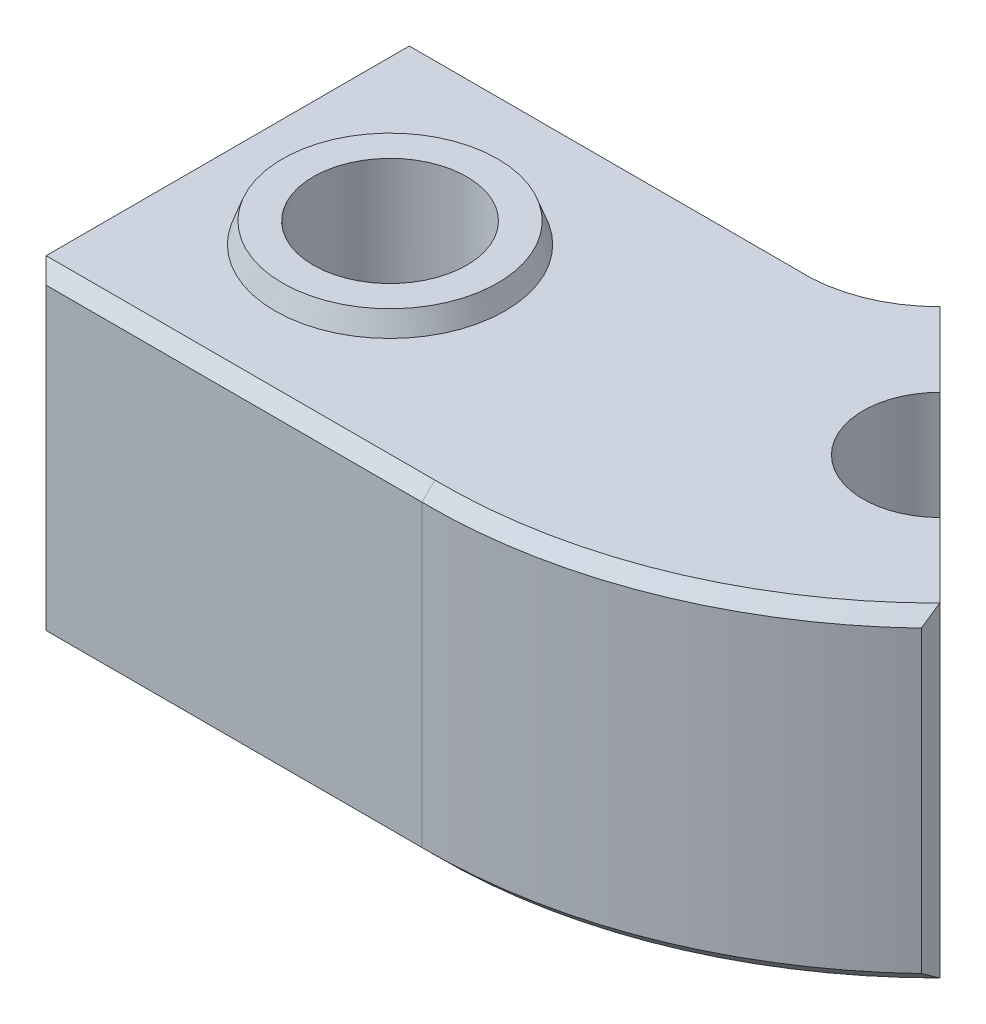
ISO-10303-21;
HEADER;
FILE_DESCRIPTION(('STEP AP214'),'2;1');
FILE_NAME('part.step','',(''),(''),'','','');
FILE_SCHEMA(('AUTOMOTIVE_DESIGN { 1 0 10303 214 1 1 1 1 }'));
ENDSEC;
DATA;
#1=APPLICATION_CONTEXT('core data for automotive mechanical design processes');
#2=APPLICATION_PROTOCOL_DEFINITION('international standard','automotive_design',2000,#1);
#3=PRODUCT_CONTEXT('',#1,'mechanical');
#4=PRODUCT('Part','Part','',(#3));
#5=PRODUCT_RELATED_PRODUCT_CATEGORY('part','',(#4));
#6=PRODUCT_DEFINITION_FORMATION('','',#4);
#7=PRODUCT_DEFINITION_CONTEXT('part definition',#1,'design');
#8=PRODUCT_DEFINITION('design','',#6,#7);
#9=PRODUCT_DEFINITION_SHAPE('','',#8);
#10=(LENGTH_UNIT() NAMED_UNIT(*) SI_UNIT(.MILLI.,.METRE.));
#11=(NAMED_UNIT(*) PLANE_ANGLE_UNIT() SI_UNIT($,.RADIAN.));
#12=(NAMED_UNIT(*) SI_UNIT($,.STERADIAN.) SOLID_ANGLE_UNIT());
#13=UNCERTAINTY_MEASURE_WITH_UNIT(LENGTH_MEASURE(1.E-05),#10,'distance_accuracy_value','');
#14=(GEOMETRIC_REPRESENTATION_CONTEXT(3) GLOBAL_UNCERTAINTY_ASSIGNED_CONTEXT((#13)) GLOBAL_UNIT_ASSIGNED_CONTEXT((#10,
#11,#12)) REPRESENTATION_CONTEXT('',''));
#15=CARTESIAN_POINT('',(0.,0.,0.));
#16=DIRECTION('',(0.,0.,1.));
#17=DIRECTION('',(1.,0.,0.));
#18=AXIS2_PLACEMENT_3D('',#15,#16,#17);
#19=CARTESIAN_POINT('',(-91.1181961207,-127.,123.955701479067));
#20=DIRECTION('',(0.,1.,0.));
#21=DIRECTION('',(0.,0.,1.));
#22=AXIS2_PLACEMENT_3D('',#19,#20,#21);
#23=CYLINDRICAL_SURFACE('',#22,30.);
#24=CARTESIAN_POINT('',(-91.1181961207,8.,123.955701479067));
#25=DIRECTION('',(0.,1.,0.));
#26=DIRECTION('',(0.,0.,1.));
#27=AXIS2_PLACEMENT_3D('',#24,#25,#26);
#28=CIRCLE('',#27,30.);
#29=CARTESIAN_POINT('',(-91.1181961207,8.,153.955701479067));
#30=VERTEX_POINT('',#29);
#31=EDGE_CURVE('E182',#30,#30,#28,.T.);
#32=ORIENTED_EDGE('',*,*,#31,.T.);
#33=EDGE_LOOP('',(#32));
#34=FACE_BOUND('',#33,.T.);
#35=CARTESIAN_POINT('',(-91.1181961207,-117.,123.955701479067));
#36=DIRECTION('',(0.,-1.,0.));
#37=DIRECTION('',(0.,0.,-1.));
#38=AXIS2_PLACEMENT_3D('',#35,#36,#37);
#39=CIRCLE('',#38,30.);
#40=CARTESIAN_POINT('',(-91.1181961207,-117.,93.9557014790674));
#41=VERTEX_POINT('',#40);
#42=EDGE_CURVE('E459',#41,#41,#39,.T.);
#43=ORIENTED_EDGE('',*,*,#42,.T.);
#44=EDGE_LOOP('',(#43));
#45=FACE_BOUND('',#44,.T.);
#46=ADVANCED_FACE('F35',(#34,#45),#23,.F.);
#47=CARTESIAN_POINT('',(0.,0.,0.));
#48=DIRECTION('',(0.,-1.,0.));
#49=DIRECTION('',(0.,0.,-1.));
#50=AXIS2_PLACEMENT_3D('',#47,#48,#49);
#51=PLANE('',#50);
#52=DIRECTION('',(-0.707106781186546,0.,-0.707106781186549));
#53=VECTOR('',#52,1.);
#54=CARTESIAN_POINT('',(33.9411254969542,0.,33.9411254969543));
#55=LINE('',#54,#53);
#56=CARTESIAN_POINT('',(66.4680374315353,0.,66.4680374315355));
#57=VERTEX_POINT('',#56);
#58=CARTESIAN_POINT('',(37.476659402887,0.,37.4766594028871));
#59=VERTEX_POINT('',#58);
#60=EDGE_CURVE('E185',#57,#59,#55,.T.);
#61=ORIENTED_EDGE('',*,*,#60,.T.);
#62=CARTESIAN_POINT('',(0.,0.,0.));
#63=DIRECTION('',(0.,-1.,0.));
#64=DIRECTION('',(0.,0.,-1.));
#65=AXIS2_PLACEMENT_3D('',#62,#63,#64);
#66=CIRCLE('',#65,53.0000000000001);
#67=CARTESIAN_POINT('',(-2.7512797438744,0.,52.9285410697382));
#68=VERTEX_POINT('',#67);
#69=EDGE_CURVE('E252',#59,#68,#66,.T.);
#70=ORIENTED_EDGE('',*,*,#69,.T.);
#71=DIRECTION('',(-1.,0.,0.));
#72=VECTOR('',#71,1.);
#73=CARTESIAN_POINT('',(-154.618196120696,0.,52.9285410697382));
#74=LINE('',#73,#72);
#75=CARTESIAN_POINT('',(-154.618196120696,0.,52.9285410697382));
#76=VERTEX_POINT('',#75);
#77=EDGE_CURVE('E250',#68,#76,#74,.T.);
#78=ORIENTED_EDGE('',*,*,#77,.T.);
#79=DIRECTION('',(0.,0.,1.));
#80=VECTOR('',#79,1.);
#81=CARTESIAN_POINT('',(-154.618196120696,0.,199.982861888397));
#82=LINE('',#81,#80);
#83=CARTESIAN_POINT('',(-154.618196120696,0.,194.982861888397));
#84=VERTEX_POINT('',#83);
#85=EDGE_CURVE('E178',#76,#84,#82,.T.);
#86=ORIENTED_EDGE('',*,*,#85,.T.);
#87=DIRECTION('',(1.,0.,0.));
#88=VECTOR('',#87,1.);
#89=CARTESIAN_POINT('',(-2.61819612069631,0.,194.982861888397));
#90=LINE('',#89,#88);
#91=CARTESIAN_POINT('',(-2.58526010498187,0.,194.982861888397));
#92=VERTEX_POINT('',#91);
#93=EDGE_CURVE('E244',#84,#92,#90,.T.);
#94=ORIENTED_EDGE('',*,*,#93,.T.);
#95=CARTESIAN_POINT('',(0.,0.,0.));
#96=DIRECTION('',(0.,-1.,0.));
#97=DIRECTION('',(0.,0.,-1.));
#98=AXIS2_PLACEMENT_3D('',#95,#96,#97);
#99=CIRCLE('',#98,195.);
#100=CARTESIAN_POINT('',(137.839310000962,0.,137.932318977311));
#101=VERTEX_POINT('',#100);
#102=EDGE_CURVE('E246',#92,#101,#99,.F.);
#103=ORIENTED_EDGE('',*,*,#102,.T.);
#104=DIRECTION('',(-0.012821566749017,0.,0.999917800334658));
#105=VECTOR('',#104,1.);
#106=CARTESIAN_POINT('',(137.748670374327,0.,145.001047617267));
#107=LINE('',#106,#105);
#108=CARTESIAN_POINT('',(137.840487520902,0.,137.840487520902));
#109=VERTEX_POINT('',#108);
#110=EDGE_CURVE('E248',#101,#109,#107,.F.);
#111=ORIENTED_EDGE('',*,*,#110,.T.);
#112=DIRECTION('',(-0.707106781186547,0.,-0.707106781186548));
#113=VECTOR('',#112,1.);
#114=CARTESIAN_POINT('',(108.894444302728,0.,108.894444302728));
#115=LINE('',#114,#113);
#116=CARTESIAN_POINT('',(108.894444302728,0.,108.894444302728));
#117=VERTEX_POINT('',#116);
#118=EDGE_CURVE('E181',#109,#117,#115,.T.);
#119=ORIENTED_EDGE('',*,*,#118,.T.);
#120=CARTESIAN_POINT('',(87.6812408671317,0.,87.681240867132));
#121=DIRECTION('',(0.,-1.,0.));
#122=DIRECTION('',(0.,0.,-1.));
#123=AXIS2_PLACEMENT_3D('',#120,#121,#122);
#124=CIRCLE('',#123,30.);
#125=EDGE_CURVE('E166',#117,#57,#124,.T.);
#126=ORIENTED_EDGE('',*,*,#125,.T.);
#127=EDGE_LOOP('',(#61,#70,#78,#86,#94,#103,#111,#119,#126));
#128=FACE_BOUND('',#127,.T.);
#129=CARTESIAN_POINT('',(-91.1181961207,0.,123.955701479067));
#130=DIRECTION('',(0.,-1.,0.));
#131=DIRECTION('',(0.,0.,-1.));
#132=AXIS2_PLACEMENT_3D('',#129,#130,#131);
#133=CIRCLE('',#132,45.);
#134=CARTESIAN_POINT('',(-91.1181961207,0.,78.9557014790674));
#135=VERTEX_POINT('',#134);
#136=EDGE_CURVE('E188',#135,#135,#133,.F.);
#137=ORIENTED_EDGE('',*,*,#136,.F.);
#138=EDGE_LOOP('',(#137));
#139=FACE_BOUND('',#138,.T.);
#140=ADVANCED_FACE('F391',(#128,#139),#51,.F.);
#141=CARTESIAN_POINT('',(0.,-127.,0.));
#142=DIRECTION('',(0.,1.,0.));
#143=DIRECTION('',(0.,0.,1.));
#144=AXIS2_PLACEMENT_3D('',#141,#142,#143);
#145=CYLINDRICAL_SURFACE('',#144,48.);
#146=DIRECTION('',(0.,1.,0.));
#147=VECTOR('',#146,1.);
#148=CARTESIAN_POINT('',(30.5877575605334,-127.,36.9917435033553));
#149=LINE('',#148,#147);
#150=CARTESIAN_POINT('',(30.5877575605334,-5.00000000000012,36.9917435033553));
#151=VERTEX_POINT('',#150);
#152=CARTESIAN_POINT('',(30.5877575605334,-122.,36.9917435033553));
#153=VERTEX_POINT('',#152);
#154=EDGE_CURVE('E229',#151,#153,#149,.F.);
#155=ORIENTED_EDGE('',*,*,#154,.T.);
#156=CARTESIAN_POINT('',(0.,-122.,0.));
#157=DIRECTION('',(0.,-1.,0.));
#158=DIRECTION('',(0.,0.,-1.));
#159=AXIS2_PLACEMENT_3D('',#156,#157,#158);
#160=CIRCLE('',#159,48.);
#161=CARTESIAN_POINT('',(-2.61819612069647,-122.,47.928541069738));
#162=VERTEX_POINT('',#161);
#163=EDGE_CURVE('E232',#153,#162,#160,.T.);
#164=ORIENTED_EDGE('',*,*,#163,.T.);
#165=DIRECTION('',(0.,1.,0.));
#166=VECTOR('',#165,1.);
#167=CARTESIAN_POINT('',(-2.61819612069647,-127.,47.928541069738));
#168=LINE('',#167,#166);
#169=CARTESIAN_POINT('',(-2.61819612069647,-5.00000000000012,47.928541069738));
#170=VERTEX_POINT('',#169);
#171=EDGE_CURVE('E174',#162,#170,#168,.T.);
#172=ORIENTED_EDGE('',*,*,#171,.T.);
#173=CARTESIAN_POINT('',(0.,-5.00000000000012,0.));
#174=DIRECTION('',(0.,-1.,0.));
#175=DIRECTION('',(0.,0.,-1.));
#176=AXIS2_PLACEMENT_3D('',#173,#174,#175);
#177=CIRCLE('',#176,48.);
#178=EDGE_CURVE('E227',#170,#151,#177,.F.);
#179=ORIENTED_EDGE('',*,*,#178,.T.);
#180=EDGE_LOOP('',(#155,#164,#172,#179));
#181=FACE_BOUND('',#180,.T.);
#182=ADVANCED_FACE('F398',(#181),#145,.F.);
#183=CARTESIAN_POINT('',(33.9411254969542,-127.,33.9411254969543));
#184=DIRECTION('',(0.707106781186549,0.,-0.707106781186546));
#185=DIRECTION('',(-0.707106781186546,0.,-0.707106781186549));
#186=AXIS2_PLACEMENT_3D('',#183,#184,#185);
#187=PLANE('',#186);
#188=DIRECTION('',(-0.707106781186546,0.,-0.707106781186549));
#189=VECTOR('',#188,1.);
#190=CARTESIAN_POINT('',(33.9411254969542,-127.,33.9411254969543));
#191=LINE('',#190,#189);
#192=CARTESIAN_POINT('',(66.4680374315353,-127.,66.4680374315355));
#193=VERTEX_POINT('',#192);
#194=CARTESIAN_POINT('',(37.476659402887,-127.,37.4766594028871));
#195=VERTEX_POINT('',#194);
#196=EDGE_CURVE('E172',#193,#195,#191,.T.);
#197=ORIENTED_EDGE('',*,*,#196,.T.);
#198=DIRECTION('',(0.499999999999999,-0.707106781186548,0.500000000000001));
#199=VECTOR('',#198,1.);
#200=CARTESIAN_POINT('',(0.,-73.9999999999999,0.));
#201=LINE('',#200,#199);
#202=CARTESIAN_POINT('',(37.3095162123552,-126.763623833092,37.3095162123554));
#203=VERTEX_POINT('',#202);
#204=EDGE_CURVE('E225',#195,#203,#201,.F.);
#205=ORIENTED_EDGE('',*,*,#204,.T.);
#206=DIRECTION('',(0.,1.,0.));
#207=VECTOR('',#206,1.);
#208=CARTESIAN_POINT('',(37.3095162123552,-127.,37.3095162123554));
#209=LINE('',#208,#207);
#210=CARTESIAN_POINT('',(37.3095162123552,-0.236376166908331,37.3095162123554));
#211=VERTEX_POINT('',#210);
#212=EDGE_CURVE('E222',#203,#211,#209,.T.);
#213=ORIENTED_EDGE('',*,*,#212,.T.);
#214=DIRECTION('',(-0.499999999999999,-0.707106781186548,-0.500000000000001));
#215=VECTOR('',#214,1.);
#216=CARTESIAN_POINT('',(0.,-53.0000000000001,0.));
#217=LINE('',#216,#215);
#218=EDGE_CURVE('E220',#211,#59,#217,.F.);
#219=ORIENTED_EDGE('',*,*,#218,.T.);
#220=ORIENTED_EDGE('',*,*,#60,.F.);
#221=DIRECTION('',(0.,1.,0.));
#222=VECTOR('',#221,1.);
#223=CARTESIAN_POINT('',(66.4680374315353,-127.,66.4680374315355));
#224=LINE('',#223,#222);
#225=EDGE_CURVE('E167',#193,#57,#224,.T.);
#226=ORIENTED_EDGE('',*,*,#225,.F.);
#227=EDGE_LOOP('',(#197,#205,#213,#219,#220,#226));
#228=FACE_BOUND('',#227,.T.);
#229=ADVANCED_FACE('F411',(#228),#187,.T.);
#230=CARTESIAN_POINT('',(87.6812408671317,-127.,87.681240867132));
#231=DIRECTION('',(0.,1.,0.));
#232=DIRECTION('',(0.,0.,1.));
#233=AXIS2_PLACEMENT_3D('',#230,#231,#232);
#234=CYLINDRICAL_SURFACE('',#233,30.);
#235=ORIENTED_EDGE('',*,*,#125,.F.);
#236=DIRECTION('',(0.,1.,0.));
#237=VECTOR('',#236,1.);
#238=CARTESIAN_POINT('',(108.894444302728,-127.,108.894444302728));
#239=LINE('',#238,#237);
#240=CARTESIAN_POINT('',(108.894444302728,-127.,108.894444302728));
#241=VERTEX_POINT('',#240);
#242=EDGE_CURVE('E152',#241,#117,#239,.T.);
#243=ORIENTED_EDGE('',*,*,#242,.F.);
#244=CARTESIAN_POINT('',(87.6812408671317,-127.,87.681240867132));
#245=DIRECTION('',(0.,-1.,0.));
#246=DIRECTION('',(0.,0.,-1.));
#247=AXIS2_PLACEMENT_3D('',#244,#245,#246);
#248=CIRCLE('',#247,30.);
#249=EDGE_CURVE('E158',#241,#193,#248,.T.);
#250=ORIENTED_EDGE('',*,*,#249,.T.);
#251=ORIENTED_EDGE('',*,*,#225,.T.);
#252=EDGE_LOOP('',(#235,#243,#250,#251));
#253=FACE_BOUND('',#252,.T.);
#254=ADVANCED_FACE('F163',(#253),#234,.F.);
#255=CARTESIAN_POINT('',(108.894444302728,-127.,108.894444302728));
#256=DIRECTION('',(0.707106781186548,0.,-0.707106781186547));
#257=DIRECTION('',(-0.707106781186547,0.,-0.707106781186548));
#258=AXIS2_PLACEMENT_3D('',#255,#256,#257);
#259=PLANE('',#258);
#260=ORIENTED_EDGE('',*,*,#118,.F.);
#261=DIRECTION('',(0.,-1.,0.));
#262=VECTOR('',#261,1.);
#263=CARTESIAN_POINT('',(137.840487520902,-127.,137.840487520902));
#264=LINE('',#263,#262);
#265=CARTESIAN_POINT('',(137.840487520902,-127.,137.840487520902));
#266=VERTEX_POINT('',#265);
#267=EDGE_CURVE('E11',#109,#266,#264,.T.);
#268=ORIENTED_EDGE('',*,*,#267,.T.);
#269=DIRECTION('',(-0.707106781186547,0.,-0.707106781186548));
#270=VECTOR('',#269,1.);
#271=CARTESIAN_POINT('',(108.894444302728,-127.,108.894444302728));
#272=LINE('',#271,#270);
#273=EDGE_CURVE('E148',#266,#241,#272,.T.);
#274=ORIENTED_EDGE('',*,*,#273,.T.);
#275=ORIENTED_EDGE('',*,*,#242,.T.);
#276=EDGE_LOOP('',(#260,#268,#274,#275));
#277=FACE_BOUND('',#276,.T.);
#278=ADVANCED_FACE('F151',(#277),#259,.T.);
#279=CARTESIAN_POINT('',(0.,-127.,0.));
#280=DIRECTION('',(0.,1.,0.));
#281=DIRECTION('',(0.,0.,1.));
#282=AXIS2_PLACEMENT_3D('',#279,#280,#281);
#283=CYLINDRICAL_SURFACE('',#282,200.);
#284=DIRECTION('',(0.,1.,0.));
#285=VECTOR('',#284,1.);
#286=CARTESIAN_POINT('',(-2.61819612069631,-127.,199.982861888397));
#287=LINE('',#286,#285);
#288=CARTESIAN_POINT('',(-2.61819612069631,-122.,199.982861888397));
#289=VERTEX_POINT('',#288);
#290=CARTESIAN_POINT('',(-2.61819612069631,-5.00000000000012,199.982861888397));
#291=VERTEX_POINT('',#290);
#292=EDGE_CURVE('E168',#289,#291,#287,.T.);
#293=ORIENTED_EDGE('',*,*,#292,.F.);
#294=CARTESIAN_POINT('',(0.,-122.,0.));
#295=DIRECTION('',(0.,-1.,0.));
#296=DIRECTION('',(0.,0.,-1.));
#297=AXIS2_PLACEMENT_3D('',#294,#295,#296);
#298=CIRCLE('',#297,200.);
#299=CARTESIAN_POINT('',(137.748670374327,-122.,145.001047617267));
#300=VERTEX_POINT('',#299);
#301=EDGE_CURVE('E45',#289,#300,#298,.F.);
#302=ORIENTED_EDGE('',*,*,#301,.T.);
#303=DIRECTION('',(0.,1.,0.));
#304=VECTOR('',#303,1.);
#305=CARTESIAN_POINT('',(137.748670374327,-127.,145.001047617267));
#306=LINE('',#305,#304);
#307=CARTESIAN_POINT('',(137.748670374327,-5.00000000000012,145.001047617267));
#308=VERTEX_POINT('',#307);
#309=EDGE_CURVE('E56',#300,#308,#306,.T.);
#310=ORIENTED_EDGE('',*,*,#309,.T.);
#311=CARTESIAN_POINT('',(0.,-5.00000000000012,0.));
#312=DIRECTION('',(0.,-1.,0.));
#313=DIRECTION('',(0.,0.,-1.));
#314=AXIS2_PLACEMENT_3D('',#311,#312,#313);
#315=CIRCLE('',#314,200.);
#316=EDGE_CURVE('E254',#308,#291,#315,.T.);
#317=ORIENTED_EDGE('',*,*,#316,.T.);
#318=EDGE_LOOP('',(#293,#302,#310,#317));
#319=FACE_BOUND('',#318,.T.);
#320=ADVANCED_FACE('F419',(#319),#283,.T.);
#321=CARTESIAN_POINT('',(-2.61819612069639,-127.,199.982861888397));
#322=DIRECTION('',(0.,0.,1.));
#323=DIRECTION('',(1.,0.,0.));
#324=AXIS2_PLACEMENT_3D('',#321,#322,#323);
#325=PLANE('',#324);
#326=DIRECTION('',(0.,-1.,0.));
#327=VECTOR('',#326,1.);
#328=CARTESIAN_POINT('',(-149.618196120696,-127.,199.982861888397));
#329=LINE('',#328,#327);
#330=CARTESIAN_POINT('',(-149.618196120696,-5.00000000000012,199.982861888397));
#331=VERTEX_POINT('',#330);
#332=CARTESIAN_POINT('',(-149.618196120696,-122.,199.982861888397));
#333=VERTEX_POINT('',#332);
#334=EDGE_CURVE('E204',#331,#333,#329,.T.);
#335=ORIENTED_EDGE('',*,*,#334,.T.);
#336=DIRECTION('',(1.,0.,0.));
#337=VECTOR('',#336,1.);
#338=CARTESIAN_POINT('',(-2.61819612069639,-122.,199.982861888397));
#339=LINE('',#338,#337);
#340=EDGE_CURVE('E206',#333,#289,#339,.T.);
#341=ORIENTED_EDGE('',*,*,#340,.T.);
#342=ORIENTED_EDGE('',*,*,#292,.T.);
#343=DIRECTION('',(-1.,0.,0.));
#344=VECTOR('',#343,1.);
#345=CARTESIAN_POINT('',(-154.618196120696,-5.00000000000012,199.982861888397));
#346=LINE('',#345,#344);
#347=EDGE_CURVE('E202',#291,#331,#346,.T.);
#348=ORIENTED_EDGE('',*,*,#347,.T.);
#349=EDGE_LOOP('',(#335,#341,#342,#348));
#350=FACE_BOUND('',#349,.T.);
#351=ADVANCED_FACE('F422',(#350),#325,.T.);
#352=CARTESIAN_POINT('',(-154.618196120696,-127.,199.982861888397));
#353=DIRECTION('',(-1.,0.,0.));
#354=DIRECTION('',(0.,0.,1.));
#355=AXIS2_PLACEMENT_3D('',#352,#353,#354);
#356=PLANE('',#355);
#357=ORIENTED_EDGE('',*,*,#85,.F.);
#358=DIRECTION('',(0.,-1.,0.));
#359=VECTOR('',#358,1.);
#360=CARTESIAN_POINT('',(-154.618196120696,-127.,52.9285410697382));
#361=LINE('',#360,#359);
#362=CARTESIAN_POINT('',(-154.618196120696,-127.,52.9285410697382));
#363=VERTEX_POINT('',#362);
#364=EDGE_CURVE('E242',#76,#363,#361,.T.);
#365=ORIENTED_EDGE('',*,*,#364,.T.);
#366=DIRECTION('',(0.,0.,1.));
#367=VECTOR('',#366,1.);
#368=CARTESIAN_POINT('',(-154.618196120696,-127.,199.982861888397));
#369=LINE('',#368,#367);
#370=CARTESIAN_POINT('',(-154.618196120696,-127.,194.982861888397));
#371=VERTEX_POINT('',#370);
#372=EDGE_CURVE('E159',#363,#371,#369,.T.);
#373=ORIENTED_EDGE('',*,*,#372,.T.);
#374=DIRECTION('',(0.,1.,0.));
#375=VECTOR('',#374,1.);
#376=CARTESIAN_POINT('',(-154.618196120696,-127.,194.982861888397));
#377=LINE('',#376,#375);
#378=EDGE_CURVE('E240',#371,#84,#377,.T.);
#379=ORIENTED_EDGE('',*,*,#378,.T.);
#380=EDGE_LOOP('',(#357,#365,#373,#379));
#381=FACE_BOUND('',#380,.T.);
#382=ADVANCED_FACE('F425',(#381),#356,.T.);
#383=CARTESIAN_POINT('',(-154.618196120696,-127.,47.928541069738));
#384=DIRECTION('',(0.,0.,-1.));
#385=DIRECTION('',(-1.,0.,0.));
#386=AXIS2_PLACEMENT_3D('',#383,#384,#385);
#387=PLANE('',#386);
#388=ORIENTED_EDGE('',*,*,#171,.F.);
#389=DIRECTION('',(-1.,0.,0.));
#390=VECTOR('',#389,1.);
#391=CARTESIAN_POINT('',(-154.618196120696,-122.,47.928541069738));
#392=LINE('',#391,#390);
#393=CARTESIAN_POINT('',(-149.618196120696,-122.,47.928541069738));
#394=VERTEX_POINT('',#393);
#395=EDGE_CURVE('E238',#162,#394,#392,.T.);
#396=ORIENTED_EDGE('',*,*,#395,.T.);
#397=DIRECTION('',(0.,1.,0.));
#398=VECTOR('',#397,1.);
#399=CARTESIAN_POINT('',(-149.618196120696,-127.,47.928541069738));
#400=LINE('',#399,#398);
#401=CARTESIAN_POINT('',(-149.618196120696,-5.00000000000012,47.928541069738));
#402=VERTEX_POINT('',#401);
#403=EDGE_CURVE('E236',#394,#402,#400,.T.);
#404=ORIENTED_EDGE('',*,*,#403,.T.);
#405=DIRECTION('',(1.,0.,0.));
#406=VECTOR('',#405,1.);
#407=CARTESIAN_POINT('',(-2.61819612069647,-5.00000000000012,47.928541069738));
#408=LINE('',#407,#406);
#409=EDGE_CURVE('E234',#402,#170,#408,.T.);
#410=ORIENTED_EDGE('',*,*,#409,.T.);
#411=EDGE_LOOP('',(#388,#396,#404,#410));
#412=FACE_BOUND('',#411,.T.);
#413=ADVANCED_FACE('F408',(#412),#387,.T.);
#414=CARTESIAN_POINT('',(0.,-127.,0.));
#415=DIRECTION('',(0.,-1.,0.));
#416=DIRECTION('',(0.,0.,-1.));
#417=AXIS2_PLACEMENT_3D('',#414,#415,#416);
#418=PLANE('',#417);
#419=CARTESIAN_POINT('',(-91.1181961207,-127.,123.955701479067));
#420=DIRECTION('',(0.,-1.,0.));
#421=DIRECTION('',(0.,0.,-1.));
#422=AXIS2_PLACEMENT_3D('',#419,#420,#421);
#423=CIRCLE('',#422,45.);
#424=CARTESIAN_POINT('',(-91.1181961207,-127.,78.9557014790674));
#425=VERTEX_POINT('',#424);
#426=EDGE_CURVE('E454',#425,#425,#423,.T.);
#427=ORIENTED_EDGE('',*,*,#426,.F.);
#428=EDGE_LOOP('',(#427));
#429=FACE_BOUND('',#428,.T.);
#430=DIRECTION('',(1.,0.,0.));
#431=VECTOR('',#430,1.);
#432=CARTESIAN_POINT('',(0.,-127.,52.9285410697382));
#433=LINE('',#432,#431);
#434=CARTESIAN_POINT('',(-2.7512797438744,-127.,52.9285410697382));
#435=VERTEX_POINT('',#434);
#436=EDGE_CURVE('E216',#363,#435,#433,.T.);
#437=ORIENTED_EDGE('',*,*,#436,.T.);
#438=CARTESIAN_POINT('',(0.,-127.,0.));
#439=DIRECTION('',(0.,-1.,0.));
#440=DIRECTION('',(0.,0.,-1.));
#441=AXIS2_PLACEMENT_3D('',#438,#439,#440);
#442=CIRCLE('',#441,53.0000000000001);
#443=EDGE_CURVE('E218',#435,#195,#442,.F.);
#444=ORIENTED_EDGE('',*,*,#443,.T.);
#445=ORIENTED_EDGE('',*,*,#196,.F.);
#446=ORIENTED_EDGE('',*,*,#249,.F.);
#447=ORIENTED_EDGE('',*,*,#273,.F.);
#448=DIRECTION('',(0.012821566749017,0.,-0.999917800334658));
#449=VECTOR('',#448,1.);
#450=CARTESIAN_POINT('',(139.585013305819,-127.,1.78984568997972));
#451=LINE('',#450,#449);
#452=CARTESIAN_POINT('',(137.839310000962,-127.,137.932318977311));
#453=VERTEX_POINT('',#452);
#454=EDGE_CURVE('E209',#266,#453,#451,.F.);
#455=ORIENTED_EDGE('',*,*,#454,.T.);
#456=CARTESIAN_POINT('',(0.,-127.,0.));
#457=DIRECTION('',(0.,-1.,0.));
#458=DIRECTION('',(0.,0.,-1.));
#459=AXIS2_PLACEMENT_3D('',#456,#457,#458);
#460=CIRCLE('',#459,195.);
#461=CARTESIAN_POINT('',(-2.58526010498187,-127.,194.982861888397));
#462=VERTEX_POINT('',#461);
#463=EDGE_CURVE('E211',#453,#462,#460,.T.);
#464=ORIENTED_EDGE('',*,*,#463,.T.);
#465=DIRECTION('',(-1.,0.,0.));
#466=VECTOR('',#465,1.);
#467=CARTESIAN_POINT('',(0.,-127.,194.982861888397));
#468=LINE('',#467,#466);
#469=EDGE_CURVE('E213',#462,#371,#468,.T.);
#470=ORIENTED_EDGE('',*,*,#469,.T.);
#471=ORIENTED_EDGE('',*,*,#372,.F.);
#472=EDGE_LOOP('',(#437,#444,#445,#446,#447,#455,#464,#470,#471));
#473=FACE_BOUND('',#472,.T.);
#474=ADVANCED_FACE('F170',(#429,#473),#418,.T.);
#475=CARTESIAN_POINT('',(-91.1181961207,8.,123.955701479067));
#476=DIRECTION('',(0.,1.,0.));
#477=DIRECTION('',(0.,0.,1.));
#478=AXIS2_PLACEMENT_3D('',#475,#476,#477);
#479=PLANE('',#478);
#480=CARTESIAN_POINT('',(-91.1181961207,8.,123.955701479067));
#481=DIRECTION('',(0.,1.,0.));
#482=DIRECTION('',(0.,0.,1.));
#483=AXIS2_PLACEMENT_3D('',#480,#481,#482);
#484=CIRCLE('',#483,42.0882381258705);
#485=CARTESIAN_POINT('',(-91.1181961207,8.,166.043939604938));
#486=VERTEX_POINT('',#485);
#487=EDGE_CURVE('E196',#486,#486,#484,.T.);
#488=ORIENTED_EDGE('',*,*,#487,.T.);
#489=EDGE_LOOP('',(#488));
#490=FACE_BOUND('',#489,.T.);
#491=ORIENTED_EDGE('',*,*,#31,.F.);
#492=EDGE_LOOP('',(#491));
#493=FACE_BOUND('',#492,.T.);
#494=ADVANCED_FACE('F405',(#490,#493),#479,.T.);
#495=CARTESIAN_POINT('',(-91.1181961207,8.,123.955701479067));
#496=DIRECTION('',(0.,-1.,0.));
#497=DIRECTION('',(0.,0.,-1.));
#498=AXIS2_PLACEMENT_3D('',#495,#496,#497);
#499=CONICAL_SURFACE('',#498,42.0882381258705,0.349065850398861);
#500=ORIENTED_EDGE('',*,*,#136,.T.);
#501=EDGE_LOOP('',(#500));
#502=FACE_BOUND('',#501,.T.);
#503=ORIENTED_EDGE('',*,*,#487,.F.);
#504=EDGE_LOOP('',(#503));
#505=FACE_BOUND('',#504,.T.);
#506=ADVANCED_FACE('F437',(#502,#505),#499,.T.);
#507=CARTESIAN_POINT('',(-91.1181961207,-117.,123.955701479067));
#508=DIRECTION('',(0.,-1.,0.));
#509=DIRECTION('',(0.,0.,-1.));
#510=AXIS2_PLACEMENT_3D('',#507,#508,#509);
#511=PLANE('',#510);
#512=CARTESIAN_POINT('',(-91.1181961207,-117.,123.955701479067));
#513=DIRECTION('',(0.,-1.,0.));
#514=DIRECTION('',(0.,0.,-1.));
#515=AXIS2_PLACEMENT_3D('',#512,#513,#514);
#516=CIRCLE('',#515,41.3602976573379);
#517=CARTESIAN_POINT('',(-91.1181961207,-117.,82.5954038217295));
#518=VERTEX_POINT('',#517);
#519=EDGE_CURVE('E199',#518,#518,#516,.T.);
#520=ORIENTED_EDGE('',*,*,#519,.T.);
#521=EDGE_LOOP('',(#520));
#522=FACE_BOUND('',#521,.T.);
#523=ORIENTED_EDGE('',*,*,#42,.F.);
#524=EDGE_LOOP('',(#523));
#525=FACE_BOUND('',#524,.T.);
#526=ADVANCED_FACE('F441',(#522,#525),#511,.T.);
#527=CARTESIAN_POINT('',(-91.1181961207,-117.,123.955701479067));
#528=DIRECTION('',(0.,-1.,0.));
#529=DIRECTION('',(0.,0.,-1.));
#530=AXIS2_PLACEMENT_3D('',#527,#528,#529);
#531=CONICAL_SURFACE('',#530,41.3602976573379,0.349065850398871);
#532=CARTESIAN_POINT('',(-91.1181961207,-127.,78.9557014790674));
#533=CARTESIAN_POINT('',(-91.1181961207,-126.895833333333,78.9936150451368));
#534=CARTESIAN_POINT('',(-91.1181961207,-126.791666666667,79.0315286112062));
#535=CARTESIAN_POINT('',(-91.1181961207,-126.583333333333,79.107355743345));
#536=CARTESIAN_POINT('',(-91.1181961207,-126.479166666667,79.1452693094144));
#537=CARTESIAN_POINT('',(-91.1181961207,-126.270833333333,79.2210964415532));
#538=CARTESIAN_POINT('',(-91.1181961207,-126.166666666667,79.2590100076226));
#539=CARTESIAN_POINT('',(-91.1181961207,-125.958333333333,79.3348371397614));
#540=CARTESIAN_POINT('',(-91.1181961207,-125.854166666667,79.3727507058308));
#541=CARTESIAN_POINT('',(-91.1181961207,-125.645833333333,79.4485778379696));
#542=CARTESIAN_POINT('',(-91.1181961207,-125.541666666667,79.4864914040389));
#543=CARTESIAN_POINT('',(-91.1181961207,-125.333333333333,79.5623185361777));
#544=CARTESIAN_POINT('',(-91.1181961207,-125.229166666667,79.6002321022471));
#545=CARTESIAN_POINT('',(-91.1181961207,-125.020833333333,79.6760592343859));
#546=CARTESIAN_POINT('',(-91.1181961207,-124.916666666667,79.7139728004553));
#547=CARTESIAN_POINT('',(-91.1181961207,-124.708333333333,79.7897999325941));
#548=CARTESIAN_POINT('',(-91.1181961207,-124.604166666667,79.8277134986635));
#549=CARTESIAN_POINT('',(-91.1181961207,-124.395833333333,79.9035406308023));
#550=CARTESIAN_POINT('',(-91.1181961207,-124.291666666667,79.9414541968717));
#551=CARTESIAN_POINT('',(-91.1181961207,-124.083333333333,80.0172813290105));
#552=CARTESIAN_POINT('',(-91.1181961207,-123.979166666667,80.0551948950799));
#553=CARTESIAN_POINT('',(-91.1181961207,-123.770833333333,80.1310220272187));
#554=CARTESIAN_POINT('',(-91.1181961207,-123.666666666667,80.1689355932881));
#555=CARTESIAN_POINT('',(-91.1181961207,-123.458333333333,80.2447627254269));
#556=CARTESIAN_POINT('',(-91.1181961207,-123.354166666667,80.2826762914963));
#557=CARTESIAN_POINT('',(-91.1181961207,-123.145833333333,80.3585034236351));
#558=CARTESIAN_POINT('',(-91.1181961207,-123.041666666667,80.3964169897045));
#559=CARTESIAN_POINT('',(-91.1181961207,-122.833333333333,80.4722441218433));
#560=CARTESIAN_POINT('',(-91.1181961207,-122.729166666667,80.5101576879127));
#561=CARTESIAN_POINT('',(-91.1181961207,-122.520833333333,80.5859848200515));
#562=CARTESIAN_POINT('',(-91.1181961207,-122.416666666667,80.6238983861208));
#563=CARTESIAN_POINT('',(-91.1181961207,-122.208333333333,80.6997255182596));
#564=CARTESIAN_POINT('',(-91.1181961207,-122.104166666667,80.737639084329));
#565=CARTESIAN_POINT('',(-91.1181961207,-121.895833333333,80.8134662164678));
#566=CARTESIAN_POINT('',(-91.1181961207,-121.791666666667,80.8513797825372));
#567=CARTESIAN_POINT('',(-91.1181961207,-121.583333333333,80.927206914676));
#568=CARTESIAN_POINT('',(-91.1181961207,-121.479166666667,80.9651204807454));
#569=CARTESIAN_POINT('',(-91.1181961207,-121.270833333333,81.0409476128842));
#570=CARTESIAN_POINT('',(-91.1181961207,-121.166666666667,81.0788611789536));
#571=CARTESIAN_POINT('',(-91.1181961207,-120.958333333333,81.1546883110924));
#572=CARTESIAN_POINT('',(-91.1181961207,-120.854166666667,81.1926018771618));
#573=CARTESIAN_POINT('',(-91.1181961207,-120.645833333333,81.2684290093006));
#574=CARTESIAN_POINT('',(-91.1181961207,-120.541666666667,81.30634257537));
#575=CARTESIAN_POINT('',(-91.1181961207,-120.333333333333,81.3821697075088));
#576=CARTESIAN_POINT('',(-91.1181961207,-120.229166666667,81.4200832735782));
#577=CARTESIAN_POINT('',(-91.1181961207,-120.020833333333,81.495910405717));
#578=CARTESIAN_POINT('',(-91.1181961207,-119.916666666667,81.5338239717864));
#579=CARTESIAN_POINT('',(-91.1181961207,-119.708333333333,81.6096511039252));
#580=CARTESIAN_POINT('',(-91.1181961207,-119.604166666667,81.6475646699946));
#581=CARTESIAN_POINT('',(-91.1181961207,-119.395833333333,81.7233918021333));
#582=CARTESIAN_POINT('',(-91.1181961207,-119.291666666667,81.7613053682027));
#583=CARTESIAN_POINT('',(-91.1181961207,-119.083333333333,81.8371325003415));
#584=CARTESIAN_POINT('',(-91.1181961207,-118.979166666667,81.8750460664109));
#585=CARTESIAN_POINT('',(-91.1181961207,-118.770833333333,81.9508731985497));
#586=CARTESIAN_POINT('',(-91.1181961207,-118.666666666667,81.9887867646191));
#587=CARTESIAN_POINT('',(-91.1181961207,-118.458333333333,82.0646138967579));
#588=CARTESIAN_POINT('',(-91.1181961207,-118.354166666667,82.1025274628273));
#589=CARTESIAN_POINT('',(-91.1181961207,-118.145833333333,82.1783545949661));
#590=CARTESIAN_POINT('',(-91.1181961207,-118.041666666667,82.2162681610355));
#591=CARTESIAN_POINT('',(-91.1181961207,-117.833333333333,82.2920952931743));
#592=CARTESIAN_POINT('',(-91.1181961207,-117.729166666667,82.3300088592437));
#593=CARTESIAN_POINT('',(-91.1181961207,-117.520833333333,82.4058359913825));
#594=CARTESIAN_POINT('',(-91.1181961207,-117.416666666667,82.4437495574519));
#595=CARTESIAN_POINT('',(-91.1181961207,-117.208333333333,82.5195766895907));
#596=CARTESIAN_POINT('',(-91.1181961207,-117.104166666667,82.5574902556601));
#597=CARTESIAN_POINT('',(-91.1181961207,-117.,82.5954038217295));
#598=B_SPLINE_CURVE_WITH_KNOTS('',3,(#532,#533,#534,#535,#536,#537,#538,#539,#540,#541,#542,
#543,#544,#545,#546,#547,#548,#549,#550,#551,#552,#553,#554,#555,#556,#557,#558,#559,#560,#561,
#562,#563,#564,#565,#566,#567,#568,#569,#570,#571,#572,#573,#574,#575,#576,#577,#578,#579,#580,
#581,#582,#583,#584,#585,#586,#587,#588,#589,#590,#591,#592,#593,#594,#595,#596,#597),
.UNSPECIFIED.,.F.,.F.,(4,2,2,2,2,2,2,2,2,2,2,2,2,2,2,2,2,2,2,2,2,2,2,2,2,2,2,2,2,2,2,2,4),(0.,
0.332555553898716,0.665111107797432,0.997666661696147,1.33022221559486,1.66277776949361,
1.99533332339232,2.32788887729104,2.66044443118977,2.99299998508849,3.32555553898722,
3.65811109288594,3.99066664678465,4.32322220068338,4.6557777545821,4.98833330848083,
5.32088886237954,5.65344441627827,5.98599997017699,6.31855552407572,6.65111107797444,
6.98366663187317,7.31622218577188,7.6487777396706,7.98133329356933,8.31388884746804,
8.64644440136678,8.97899995526549,9.31155550916423,9.64411106306294,9.97666661696167,
10.3092221708604,10.6417777247591),.UNSPECIFIED.);
#599=EDGE_CURVE('BSEAM320',#425,#518,#598,.T.);
#600=ORIENTED_EDGE('',*,*,#426,.T.);
#601=ORIENTED_EDGE('',*,*,#519,.F.);
#602=ORIENTED_EDGE('',*,*,#599,.T.);
#603=ORIENTED_EDGE('',*,*,#599,.F.);
#604=EDGE_LOOP('',(#600,#602,#601,#603));
#605=FACE_BOUND('',#604,.T.);
#606=ADVANCED_FACE('F320',(#605),#531,.F.);
#607=CARTESIAN_POINT('',(0.,0.,0.));
#608=DIRECTION('',(0.,-1.,0.));
#609=DIRECTION('',(0.,0.,-1.));
#610=AXIS2_PLACEMENT_3D('',#607,#608,#609);
#611=CONICAL_SURFACE('',#610,195.,0.785398163397448);
#612=CARTESIAN_POINT('',(137.748670374327,-5.00000000000012,145.001047617267));
#613=CARTESIAN_POINT('',(137.756192304158,-4.57988273596643,144.414433541362));
#614=CARTESIAN_POINT('',(137.763721864013,-4.16059620242156,143.827224421319));
#615=CARTESIAN_POINT('',(137.778796507152,-3.32373521724659,142.651595552898));
#616=CARTESIAN_POINT('',(137.786341590297,-2.90616075043534,142.063175815324));
#617=CARTESIAN_POINT('',(137.801447679616,-2.07276691071571,140.885094548137));
#618=CARTESIAN_POINT('',(137.809008685795,-1.65694753839959,140.295433018105));
#619=CARTESIAN_POINT('',(137.824147027533,-0.827109751955586,139.114836475725));
#620=CARTESIAN_POINT('',(137.831724363237,-0.413091353864861,138.523901452108));
#621=CARTESIAN_POINT('',(137.839310000962,0.,137.932318977311));
#622=B_SPLINE_CURVE_WITH_KNOTS('',3,(#612,#613,#614,#615,#616,#617,#618,#619,#620,#621),
.UNSPECIFIED.,.F.,.F.,(4,2,2,2,4),(0.,2.16472593567518,4.329432634684,6.49414006412019,
8.65886673037118),.UNSPECIFIED.);
#623=EDGE_CURVE('E296',#101,#308,#622,.F.);
#624=ORIENTED_EDGE('',*,*,#623,.F.);
#625=ORIENTED_EDGE('',*,*,#102,.F.);
#626=CARTESIAN_POINT('',(-2.61819612069631,-5.00000000000012,199.982861888397));
#627=CARTESIAN_POINT('',(-2.61274152952287,-4.1666665522336,199.14952844063));
#628=CARTESIAN_POINT('',(-2.60726956595985,-3.33333316168482,198.316195050081));
#629=CARTESIAN_POINT('',(-2.5962908940546,-1.66666649501811,196.649528383415));
#630=CARTESIAN_POINT('',(-2.59078418571237,-0.833333218900193,195.816195107297));
#631=CARTESIAN_POINT('',(-2.58526010498055,0.,194.982861888397));
#632=B_SPLINE_CURVE_WITH_KNOTS('',3,(#626,#627,#628,#629,#630,#631),.UNSPECIFIED.,.F.,.F.,(4,2,
4),(0.,3.53557225890391,7.07114451782728),.UNSPECIFIED.);
#633=EDGE_CURVE('E304',#291,#92,#632,.T.);
#634=ORIENTED_EDGE('',*,*,#633,.F.);
#635=ORIENTED_EDGE('',*,*,#316,.F.);
#636=EDGE_LOOP('',(#624,#625,#634,#635));
#637=FACE_BOUND('',#636,.T.);
#638=ADVANCED_FACE('F312',(#637),#611,.T.);
#639=CARTESIAN_POINT('',(0.,0.,194.982861888397));
#640=DIRECTION('',(0.,0.707106781186548,0.707106781186548));
#641=DIRECTION('',(-1.,0.,0.));
#642=AXIS2_PLACEMENT_3D('',#639,#640,#641);
#643=PLANE('',#642);
#644=ORIENTED_EDGE('',*,*,#633,.T.);
#645=ORIENTED_EDGE('',*,*,#93,.F.);
#646=DIRECTION('',(-0.577350269189626,0.577350269189626,-0.577350269189626));
#647=VECTOR('',#646,1.);
#648=CARTESIAN_POINT('',(-103.078797413798,-51.5393987068988,246.522260595295));
#649=LINE('',#648,#647);
#650=EDGE_CURVE('E293',#331,#84,#649,.T.);
#651=ORIENTED_EDGE('',*,*,#650,.F.);
#652=ORIENTED_EDGE('',*,*,#347,.F.);
#653=EDGE_LOOP('',(#644,#645,#651,#652));
#654=FACE_BOUND('',#653,.T.);
#655=ADVANCED_FACE('F319',(#654),#643,.T.);
#656=CARTESIAN_POINT('',(137.748670374327,-127.,145.001047617267));
#657=DIRECTION('',(-0.999917800334658,0.,-0.012821566749017));
#658=DIRECTION('',(0.,1.,0.));
#659=AXIS2_PLACEMENT_3D('',#656,#657,#658);
#660=PLANE('',#659);
#661=ORIENTED_EDGE('',*,*,#623,.T.);
#662=ORIENTED_EDGE('',*,*,#309,.F.);
#663=CARTESIAN_POINT('',(137.748670374327,-122.,145.001047617267));
#664=CARTESIAN_POINT('',(137.756192304158,-122.420117264034,144.414433541362));
#665=CARTESIAN_POINT('',(137.763721864013,-122.839403797578,143.827224421319));
#666=CARTESIAN_POINT('',(137.778796507152,-123.676264782753,142.651595552898));
#667=CARTESIAN_POINT('',(137.786341590297,-124.093839249565,142.063175815324));
#668=CARTESIAN_POINT('',(137.801447679616,-124.927233089284,140.885094548137));
#669=CARTESIAN_POINT('',(137.809008685795,-125.3430524616,140.295433018105));
#670=CARTESIAN_POINT('',(137.824147027533,-126.172890248044,139.114836475726));
#671=CARTESIAN_POINT('',(137.831724363237,-126.586908646135,138.523901452108));
#672=CARTESIAN_POINT('',(137.839310000962,-127.,137.932318977311));
#673=B_SPLINE_CURVE_WITH_KNOTS('',3,(#663,#664,#665,#666,#667,#668,#669,#670,#671,#672),
.UNSPECIFIED.,.F.,.F.,(4,2,2,2,4),(0.,2.16472593567518,4.329432634684,6.49414006412016,
8.65886673037119),.UNSPECIFIED.);
#674=EDGE_CURVE('E286',#453,#300,#673,.F.);
#675=ORIENTED_EDGE('',*,*,#674,.F.);
#676=ORIENTED_EDGE('',*,*,#454,.F.);
#677=ORIENTED_EDGE('',*,*,#267,.F.);
#678=ORIENTED_EDGE('',*,*,#110,.F.);
#679=EDGE_LOOP('',(#661,#662,#675,#676,#677,#678));
#680=FACE_BOUND('',#679,.T.);
#681=ADVANCED_FACE('F282',(#680),#660,.F.);
#682=CARTESIAN_POINT('',(-154.618196120696,-127.,194.982861888397));
#683=DIRECTION('',(0.707106781186548,0.,-0.707106781186548));
#684=DIRECTION('',(0.,1.,0.));
#685=AXIS2_PLACEMENT_3D('',#682,#683,#684);
#686=PLANE('',#685);
#687=ORIENTED_EDGE('',*,*,#650,.T.);
#688=ORIENTED_EDGE('',*,*,#378,.F.);
#689=DIRECTION('',(0.577350269189626,0.577350269189626,0.577350269189626));
#690=VECTOR('',#689,1.);
#691=CARTESIAN_POINT('',(-154.618196120696,-127.,194.982861888397));
#692=LINE('',#691,#690);
#693=EDGE_CURVE('E266',#333,#371,#692,.F.);
#694=ORIENTED_EDGE('',*,*,#693,.F.);
#695=ORIENTED_EDGE('',*,*,#334,.F.);
#696=EDGE_LOOP('',(#687,#688,#694,#695));
#697=FACE_BOUND('',#696,.T.);
#698=ADVANCED_FACE('F280',(#697),#686,.F.);
#699=CARTESIAN_POINT('',(0.,-122.,0.));
#700=DIRECTION('',(0.,1.,0.));
#701=DIRECTION('',(0.,0.,1.));
#702=AXIS2_PLACEMENT_3D('',#699,#700,#701);
#703=CONICAL_SURFACE('',#702,200.,0.785398163397448);
#704=ORIENTED_EDGE('',*,*,#674,.T.);
#705=ORIENTED_EDGE('',*,*,#301,.F.);
#706=CARTESIAN_POINT('',(-2.61819612069631,-122.,199.982861888397));
#707=CARTESIAN_POINT('',(-2.61274152952289,-122.833333447766,199.14952844063));
#708=CARTESIAN_POINT('',(-2.60726956595989,-123.666666838315,198.316195050081));
#709=CARTESIAN_POINT('',(-2.59629089405464,-125.333333504982,196.649528383415));
#710=CARTESIAN_POINT('',(-2.59078418571241,-126.1666667811,195.816195107297));
#711=CARTESIAN_POINT('',(-2.58526010498058,-127.,194.982861888397));
#712=B_SPLINE_CURVE_WITH_KNOTS('',3,(#706,#707,#708,#709,#710,#711),.UNSPECIFIED.,.F.,.F.,(4,2,
4),(0.,3.53557225890391,7.07114451782728),.UNSPECIFIED.);
#713=EDGE_CURVE('E258',#462,#289,#712,.F.);
#714=ORIENTED_EDGE('',*,*,#713,.F.);
#715=ORIENTED_EDGE('',*,*,#463,.F.);
#716=EDGE_LOOP('',(#704,#705,#714,#715));
#717=FACE_BOUND('',#716,.T.);
#718=ADVANCED_FACE('F273',(#717),#703,.T.);
#719=CARTESIAN_POINT('',(-2.61819612069639,-122.,199.982861888397));
#720=DIRECTION('',(0.,0.707106781186548,-0.707106781186548));
#721=DIRECTION('',(1.,0.,0.));
#722=AXIS2_PLACEMENT_3D('',#719,#720,#721);
#723=PLANE('',#722);
#724=ORIENTED_EDGE('',*,*,#693,.T.);
#725=ORIENTED_EDGE('',*,*,#469,.F.);
#726=ORIENTED_EDGE('',*,*,#713,.T.);
#727=ORIENTED_EDGE('',*,*,#340,.F.);
#728=EDGE_LOOP('',(#724,#725,#726,#727));
#729=FACE_BOUND('',#728,.T.);
#730=ADVANCED_FACE('F269',(#729),#723,.F.);
#731=CARTESIAN_POINT('',(-149.618196120696,-127.,47.928541069738));
#732=DIRECTION('',(0.707106781186548,0.,0.707106781186548));
#733=DIRECTION('',(0.,1.,0.));
#734=AXIS2_PLACEMENT_3D('',#731,#732,#733);
#735=PLANE('',#734);
#736=DIRECTION('',(0.577350269189626,-0.577350269189626,-0.577350269189626));
#737=VECTOR('',#736,1.);
#738=CARTESIAN_POINT('',(-103.078797413798,-51.5393987068988,1.38914236283933));
#739=LINE('',#738,#737);
#740=EDGE_CURVE('E477',#402,#76,#739,.F.);
#741=ORIENTED_EDGE('',*,*,#740,.F.);
#742=ORIENTED_EDGE('',*,*,#403,.F.);
#743=DIRECTION('',(-0.577350269189626,-0.577350269189626,0.577350269189626));
#744=VECTOR('',#743,1.);
#745=CARTESIAN_POINT('',(-151.284862787363,-123.666666666667,49.5952077364047));
#746=LINE('',#745,#744);
#747=EDGE_CURVE('E40',#363,#394,#746,.F.);
#748=ORIENTED_EDGE('',*,*,#747,.F.);
#749=ORIENTED_EDGE('',*,*,#364,.F.);
#750=EDGE_LOOP('',(#741,#742,#748,#749));
#751=FACE_BOUND('',#750,.T.);
#752=ADVANCED_FACE('F38',(#751),#735,.F.);
#753=CARTESIAN_POINT('',(-154.618196120696,-122.,47.928541069738));
#754=DIRECTION('',(0.,0.707106781186548,0.707106781186548));
#755=DIRECTION('',(-1.,0.,0.));
#756=AXIS2_PLACEMENT_3D('',#753,#754,#755);
#757=PLANE('',#756);
#758=ORIENTED_EDGE('',*,*,#747,.T.);
#759=ORIENTED_EDGE('',*,*,#395,.F.);
#760=CARTESIAN_POINT('',(-2.61819612069647,-122.,47.928541069738));
#761=CARTESIAN_POINT('',(-2.64092619671481,-122.833326023002,48.7618670927401));
#762=CARTESIAN_POINT('',(-2.66338153668457,-123.666655702291,49.5951967720291));
#763=CARTESIAN_POINT('',(-2.70774274440756,-125.333322368958,51.2618634386959));
#764=CARTESIAN_POINT('',(-2.72964861216375,-126.166659356335,52.0952004260736));
#765=CARTESIAN_POINT('',(-2.75127974387432,-127.,52.9285410697381));
#766=B_SPLINE_CURVE_WITH_KNOTS('',3,(#760,#761,#762,#763,#764,#765),.UNSPECIFIED.,.F.,.F.,(4,2,
4),(0.,3.53616014336856,7.07232026770555),.UNSPECIFIED.);
#767=EDGE_CURVE('E359',#435,#162,#766,.F.);
#768=ORIENTED_EDGE('',*,*,#767,.F.);
#769=ORIENTED_EDGE('',*,*,#436,.F.);
#770=EDGE_LOOP('',(#758,#759,#768,#769));
#771=FACE_BOUND('',#770,.T.);
#772=ADVANCED_FACE('F377',(#771),#757,.F.);
#773=CARTESIAN_POINT('',(0.,0.,52.9285410697382));
#774=DIRECTION('',(0.,0.707106781186548,-0.707106781186548));
#775=DIRECTION('',(1.,0.,0.));
#776=AXIS2_PLACEMENT_3D('',#773,#774,#775);
#777=PLANE('',#776);
#778=ORIENTED_EDGE('',*,*,#740,.T.);
#779=ORIENTED_EDGE('',*,*,#77,.F.);
#780=CARTESIAN_POINT('',(-2.7512797438744,0.,52.9285410697381));
#781=CARTESIAN_POINT('',(-2.72964861216368,-0.833340643664557,52.0952004260736));
#782=CARTESIAN_POINT('',(-2.70774274440746,-1.66667763104228,51.2618634386959));
#783=CARTESIAN_POINT('',(-2.66338153668468,-3.33334429770902,49.5951967720291));
#784=CARTESIAN_POINT('',(-2.64092619671515,-4.16667397699801,48.7618670927401));
#785=CARTESIAN_POINT('',(-2.61819612069717,-5.00000000000013,47.928541069738));
#786=B_SPLINE_CURVE_WITH_KNOTS('',3,(#780,#781,#782,#783,#784,#785),.UNSPECIFIED.,.F.,.F.,(4,2,
4),(0.,3.536160124337,7.07232026770556),.UNSPECIFIED.);
#787=EDGE_CURVE('E351',#170,#68,#786,.F.);
#788=ORIENTED_EDGE('',*,*,#787,.F.);
#789=ORIENTED_EDGE('',*,*,#409,.F.);
#790=EDGE_LOOP('',(#778,#779,#788,#789));
#791=FACE_BOUND('',#790,.T.);
#792=ADVANCED_FACE('F370',(#791),#777,.T.);
#793=CARTESIAN_POINT('',(0.,-122.,0.));
#794=DIRECTION('',(0.,-1.,0.));
#795=DIRECTION('',(0.,0.,-1.));
#796=AXIS2_PLACEMENT_3D('',#793,#794,#795);
#797=CONICAL_SURFACE('',#796,48.,0.785398163397448);
#798=ORIENTED_EDGE('',*,*,#767,.T.);
#799=ORIENTED_EDGE('',*,*,#163,.F.);
#800=CARTESIAN_POINT('',(30.5877575605334,-122.,36.9917435033553));
#801=CARTESIAN_POINT('',(31.1572200090776,-122.383654182811,37.0186649735123));
#802=CARTESIAN_POINT('',(31.724120894696,-122.771100363894,37.0454653451842));
#803=CARTESIAN_POINT('',(32.853098815263,-123.552828717686,37.0988380398617));
#804=CARTESIAN_POINT('',(33.4151764366651,-123.947110041196,37.1254103905921));
#805=CARTESIAN_POINT('',(34.5349376374878,-124.741848732582,37.1783473626927));
#806=CARTESIAN_POINT('',(35.0926212935278,-125.142305992403,37.2047119876852));
#807=CARTESIAN_POINT('',(36.2039981588971,-125.948877500468,37.2572525883705));
#808=CARTESIAN_POINT('',(36.7576908676022,-126.354992440297,37.2834285403963));
#809=CARTESIAN_POINT('',(37.3095162123552,-126.763623833092,37.3095162123554));
#810=B_SPLINE_CURVE_WITH_KNOTS('',3,(#800,#801,#802,#803,#804,#805,#806,#807,#808,#809),
.UNSPECIFIED.,.F.,.F.,(4,2,2,2,4),(0.,2.06148013445744,4.12270596019746,6.18389576353356,
8.24533977332529),.UNSPECIFIED.);
#811=EDGE_CURVE('E360',#203,#153,#810,.F.);
#812=ORIENTED_EDGE('',*,*,#811,.F.);
#813=ORIENTED_EDGE('',*,*,#204,.F.);
#814=ORIENTED_EDGE('',*,*,#443,.F.);
#815=EDGE_LOOP('',(#798,#799,#812,#813,#814));
#816=FACE_BOUND('',#815,.T.);
#817=ADVANCED_FACE('F339',(#816),#797,.F.);
#818=CARTESIAN_POINT('',(0.,0.,0.));
#819=DIRECTION('',(0.,1.,0.));
#820=DIRECTION('',(0.,0.,1.));
#821=AXIS2_PLACEMENT_3D('',#818,#819,#820);
#822=CONICAL_SURFACE('',#821,53.0000000000001,0.785398163397448);
#823=ORIENTED_EDGE('',*,*,#69,.F.);
#824=ORIENTED_EDGE('',*,*,#218,.F.);
#825=CARTESIAN_POINT('',(37.3095162123552,-0.236376166908338,37.3095162123554));
#826=CARTESIAN_POINT('',(36.7576908676022,-0.645007559702576,37.2834285403963));
#827=CARTESIAN_POINT('',(36.2039981588971,-1.05112249953176,37.2572525883705));
#828=CARTESIAN_POINT('',(35.0926212935278,-1.85769400759704,37.2047119876852));
#829=CARTESIAN_POINT('',(34.5349376374878,-2.25815126741823,37.1783473626927));
#830=CARTESIAN_POINT('',(33.4151764366651,-3.05288995880362,37.1254103905921));
#831=CARTESIAN_POINT('',(32.853098815263,-3.44717128231358,37.0988380398617));
#832=CARTESIAN_POINT('',(31.724120894696,-4.22889963610583,37.0454653451842));
#833=CARTESIAN_POINT('',(31.1572200090776,-4.61634581718893,37.0186649735123));
#834=CARTESIAN_POINT('',(30.5877575605334,-5.00000000000011,36.9917435033553));
#835=B_SPLINE_CURVE_WITH_KNOTS('',3,(#825,#826,#827,#828,#829,#830,#831,#832,#833,#834),
.UNSPECIFIED.,.F.,.F.,(4,2,2,2,4),(0.,2.06144400979175,4.12263381312783,6.18385963886785,
8.24533977332528),.UNSPECIFIED.);
#836=EDGE_CURVE('E344',#151,#211,#835,.F.);
#837=ORIENTED_EDGE('',*,*,#836,.F.);
#838=ORIENTED_EDGE('',*,*,#178,.F.);
#839=ORIENTED_EDGE('',*,*,#787,.T.);
#840=EDGE_LOOP('',(#823,#824,#837,#838,#839));
#841=FACE_BOUND('',#840,.T.);
#842=ADVANCED_FACE('F331',(#841),#822,.F.);
#843=CARTESIAN_POINT('',(37.3095162123552,-127.,37.3095162123554));
#844=DIRECTION('',(-0.0472224929324787,0.,0.998884395794249));
#845=DIRECTION('',(0.,1.,0.));
#846=AXIS2_PLACEMENT_3D('',#843,#844,#845);
#847=PLANE('',#846);
#848=ORIENTED_EDGE('',*,*,#811,.T.);
#849=ORIENTED_EDGE('',*,*,#154,.F.);
#850=ORIENTED_EDGE('',*,*,#836,.T.);
#851=ORIENTED_EDGE('',*,*,#212,.F.);
#852=EDGE_LOOP('',(#848,#849,#850,#851));
#853=FACE_BOUND('',#852,.T.);
#854=ADVANCED_FACE('F338',(#853),#847,.F.);
#855=CLOSED_SHELL('',(#46,#140,#182,#229,#254,#278,#320,#351,#382,#413,#474,#494,#506,#526,#606,
#638,#655,#681,#698,#718,#730,#752,#772,#792,#817,#842,#854));
#856=MANIFOLD_SOLID_BREP('B2',#855);
#857=ADVANCED_BREP_SHAPE_REPRESENTATION('',(#18,#856),#14);
#858=SHAPE_DEFINITION_REPRESENTATION(#9,#857);
ENDSEC;
END-ISO-10303-21;
